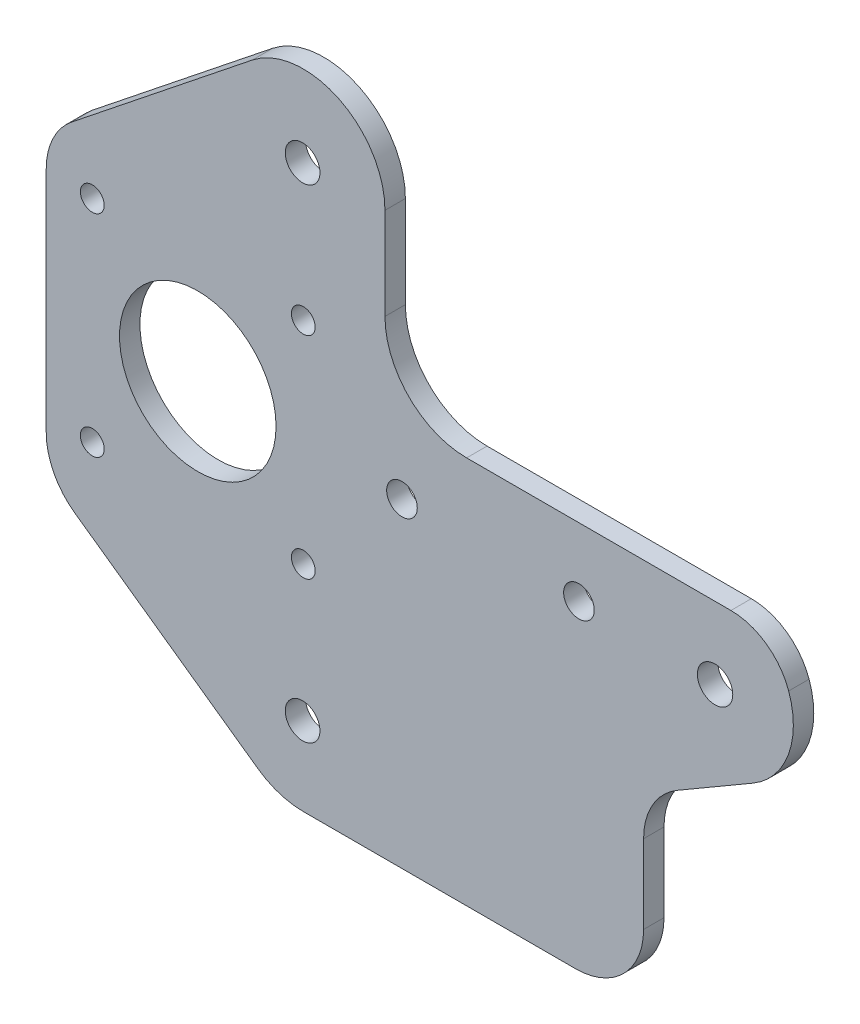
ISO-10303-21;
HEADER;
FILE_DESCRIPTION(('STEP AP214'),'2;1');
FILE_NAME('part.step','',(''),(''),'','','');
FILE_SCHEMA(('AUTOMOTIVE_DESIGN { 1 0 10303 214 1 1 1 1 }'));
ENDSEC;
DATA;
#1=APPLICATION_CONTEXT('core data for automotive mechanical design processes');
#2=APPLICATION_PROTOCOL_DEFINITION('international standard','automotive_design',2000,#1);
#3=PRODUCT_CONTEXT('',#1,'mechanical');
#4=PRODUCT('Part','Part','',(#3));
#5=PRODUCT_RELATED_PRODUCT_CATEGORY('part','',(#4));
#6=PRODUCT_DEFINITION_FORMATION('','',#4);
#7=PRODUCT_DEFINITION_CONTEXT('part definition',#1,'design');
#8=PRODUCT_DEFINITION('design','',#6,#7);
#9=PRODUCT_DEFINITION_SHAPE('','',#8);
#10=(LENGTH_UNIT() NAMED_UNIT(*) SI_UNIT(.MILLI.,.METRE.));
#11=(NAMED_UNIT(*) PLANE_ANGLE_UNIT() SI_UNIT($,.RADIAN.));
#12=(NAMED_UNIT(*) SI_UNIT($,.STERADIAN.) SOLID_ANGLE_UNIT());
#13=UNCERTAINTY_MEASURE_WITH_UNIT(LENGTH_MEASURE(1.E-05),#10,'distance_accuracy_value','');
#14=(GEOMETRIC_REPRESENTATION_CONTEXT(3) GLOBAL_UNCERTAINTY_ASSIGNED_CONTEXT((#13)) GLOBAL_UNIT_ASSIGNED_CONTEXT((#10,
#11,#12)) REPRESENTATION_CONTEXT('',''));
#15=CARTESIAN_POINT('',(0.,0.,0.));
#16=DIRECTION('',(0.,0.,1.));
#17=DIRECTION('',(1.,0.,0.));
#18=AXIS2_PLACEMENT_3D('',#15,#16,#17);
#19=CARTESIAN_POINT('',(0.,0.,0.));
#20=DIRECTION('',(0.,0.,1.));
#21=DIRECTION('',(1.,0.,0.));
#22=AXIS2_PLACEMENT_3D('',#19,#20,#21);
#23=PLANE('',#22);
#24=CARTESIAN_POINT('',(30.,0.,0.));
#25=DIRECTION('',(0.,0.,1.));
#26=DIRECTION('',(1.,0.,0.));
#27=AXIS2_PLACEMENT_3D('',#24,#25,#26);
#28=CIRCLE('',#27,2.25);
#29=CARTESIAN_POINT('',(32.25,0.,0.));
#30=VERTEX_POINT('',#29);
#31=EDGE_CURVE('E152',#30,#30,#28,.T.);
#32=ORIENTED_EDGE('',*,*,#31,.T.);
#33=EDGE_LOOP('',(#32));
#34=FACE_BOUND('',#33,.T.);
#35=CARTESIAN_POINT('',(15.4,-35.5,0.));
#36=DIRECTION('',(0.,0.,1.));
#37=DIRECTION('',(1.,0.,0.));
#38=AXIS2_PLACEMENT_3D('',#35,#36,#37);
#39=CIRCLE('',#38,2.55);
#40=CARTESIAN_POINT('',(17.95,-35.5,0.));
#41=VERTEX_POINT('',#40);
#42=EDGE_CURVE('E280',#41,#41,#39,.T.);
#43=ORIENTED_EDGE('',*,*,#42,.T.);
#44=EDGE_LOOP('',(#43));
#45=FACE_BOUND('',#44,.T.);
#46=CARTESIAN_POINT('',(15.4,35.5,0.));
#47=DIRECTION('',(0.,0.,1.));
#48=DIRECTION('',(1.,0.,0.));
#49=AXIS2_PLACEMENT_3D('',#46,#47,#48);
#50=CIRCLE('',#49,2.55);
#51=CARTESIAN_POINT('',(17.95,35.5,0.));
#52=VERTEX_POINT('',#51);
#53=EDGE_CURVE('E259',#52,#52,#50,.T.);
#54=ORIENTED_EDGE('',*,*,#53,.T.);
#55=EDGE_LOOP('',(#54));
#56=FACE_BOUND('',#55,.T.);
#57=CARTESIAN_POINT('',(-15.5,15.5,0.));
#58=DIRECTION('',(0.,0.,1.));
#59=DIRECTION('',(1.,0.,0.));
#60=AXIS2_PLACEMENT_3D('',#57,#58,#59);
#61=CIRCLE('',#60,1.75);
#62=CARTESIAN_POINT('',(-13.75,15.5,0.));
#63=VERTEX_POINT('',#62);
#64=EDGE_CURVE('E283',#63,#63,#61,.T.);
#65=ORIENTED_EDGE('',*,*,#64,.T.);
#66=EDGE_LOOP('',(#65));
#67=FACE_BOUND('',#66,.T.);
#68=CARTESIAN_POINT('',(-15.5,-15.5,0.));
#69=DIRECTION('',(0.,0.,1.));
#70=DIRECTION('',(1.,0.,0.));
#71=AXIS2_PLACEMENT_3D('',#68,#69,#70);
#72=CIRCLE('',#71,1.75);
#73=CARTESIAN_POINT('',(-13.75,-15.5,0.));
#74=VERTEX_POINT('',#73);
#75=EDGE_CURVE('E256',#74,#74,#72,.T.);
#76=ORIENTED_EDGE('',*,*,#75,.T.);
#77=EDGE_LOOP('',(#76));
#78=FACE_BOUND('',#77,.T.);
#79=CARTESIAN_POINT('',(15.5,-15.5,0.));
#80=DIRECTION('',(0.,0.,1.));
#81=DIRECTION('',(1.,0.,0.));
#82=AXIS2_PLACEMENT_3D('',#79,#80,#81);
#83=CIRCLE('',#82,1.75);
#84=CARTESIAN_POINT('',(17.25,-15.5,0.));
#85=VERTEX_POINT('',#84);
#86=EDGE_CURVE('E286',#85,#85,#83,.T.);
#87=ORIENTED_EDGE('',*,*,#86,.T.);
#88=EDGE_LOOP('',(#87));
#89=FACE_BOUND('',#88,.T.);
#90=CARTESIAN_POINT('',(15.5,15.5,0.));
#91=DIRECTION('',(0.,0.,1.));
#92=DIRECTION('',(1.,0.,0.));
#93=AXIS2_PLACEMENT_3D('',#90,#91,#92);
#94=CIRCLE('',#93,1.75);
#95=CARTESIAN_POINT('',(17.25,15.5,0.));
#96=VERTEX_POINT('',#95);
#97=EDGE_CURVE('E253',#96,#96,#94,.T.);
#98=ORIENTED_EDGE('',*,*,#97,.T.);
#99=EDGE_LOOP('',(#98));
#100=FACE_BOUND('',#99,.T.);
#101=CARTESIAN_POINT('',(0.,0.,0.));
#102=DIRECTION('',(0.,0.,1.));
#103=DIRECTION('',(1.,0.,0.));
#104=AXIS2_PLACEMENT_3D('',#101,#102,#103);
#105=CIRCLE('',#104,11.5);
#106=CARTESIAN_POINT('',(11.5,0.,0.));
#107=VERTEX_POINT('',#106);
#108=EDGE_CURVE('E288',#107,#107,#105,.T.);
#109=ORIENTED_EDGE('',*,*,#108,.T.);
#110=EDGE_LOOP('',(#109));
#111=FACE_BOUND('',#110,.T.);
#112=CARTESIAN_POINT('',(56.,0.,0.));
#113=DIRECTION('',(0.,0.,1.));
#114=DIRECTION('',(1.,0.,0.));
#115=AXIS2_PLACEMENT_3D('',#112,#113,#114);
#116=CIRCLE('',#115,2.25);
#117=CARTESIAN_POINT('',(58.25,0.,0.));
#118=VERTEX_POINT('',#117);
#119=EDGE_CURVE('E250',#118,#118,#116,.T.);
#120=ORIENTED_EDGE('',*,*,#119,.T.);
#121=EDGE_LOOP('',(#120));
#122=FACE_BOUND('',#121,.T.);
#123=CARTESIAN_POINT('',(75.5,0.,0.));
#124=DIRECTION('',(0.,0.,1.));
#125=DIRECTION('',(1.,0.,0.));
#126=AXIS2_PLACEMENT_3D('',#123,#124,#125);
#127=CIRCLE('',#126,12.);
#128=CARTESIAN_POINT('',(81.5363224728649,-10.3712492499026,0.));
#129=VERTEX_POINT('',#128);
#130=CARTESIAN_POINT('',(86.8137084989854,4.00000000000889,0.));
#131=VERTEX_POINT('',#130);
#132=EDGE_CURVE('E264',#129,#131,#127,.T.);
#133=ORIENTED_EDGE('',*,*,#132,.F.);
#134=DIRECTION('',(0.864270770825398,0.503026872738299,0.));
#135=VECTOR('',#134,1.);
#136=CARTESIAN_POINT('',(21.28480903649,-45.43911386449,0.));
#137=LINE('',#136,#135);
#138=CARTESIAN_POINT('',(70.4697312726384,-16.8122778618127,0.));
#139=VERTEX_POINT('',#138);
#140=EDGE_CURVE('E166',#139,#129,#137,.T.);
#141=ORIENTED_EDGE('',*,*,#140,.F.);
#142=CARTESIAN_POINT('',(75.5,-25.45498557008,0.));
#143=DIRECTION('',(0.,0.,1.));
#144=DIRECTION('',(1.,0.,0.));
#145=AXIS2_PLACEMENT_3D('',#142,#143,#144);
#146=CIRCLE('',#145,10.);
#147=CARTESIAN_POINT('',(65.5,-25.45498557008,0.));
#148=VERTEX_POINT('',#147);
#149=EDGE_CURVE('E174',#139,#148,#146,.T.);
#150=ORIENTED_EDGE('',*,*,#149,.T.);
#151=DIRECTION('',(0.,1.,0.));
#152=VECTOR('',#151,1.);
#153=CARTESIAN_POINT('',(65.5,-47.,0.));
#154=LINE('',#153,#152);
#155=CARTESIAN_POINT('',(65.5,-37.,0.));
#156=VERTEX_POINT('',#155);
#157=EDGE_CURVE('E171',#156,#148,#154,.T.);
#158=ORIENTED_EDGE('',*,*,#157,.F.);
#159=CARTESIAN_POINT('',(55.5,-37.,0.));
#160=DIRECTION('',(0.,0.,-1.));
#161=DIRECTION('',(-1.,0.,0.));
#162=AXIS2_PLACEMENT_3D('',#159,#160,#161);
#163=CIRCLE('',#162,10.);
#164=CARTESIAN_POINT('',(55.5,-47.,0.));
#165=VERTEX_POINT('',#164);
#166=EDGE_CURVE('E269',#165,#156,#163,.F.);
#167=ORIENTED_EDGE('',*,*,#166,.F.);
#168=DIRECTION('',(1.,0.,0.));
#169=VECTOR('',#168,1.);
#170=CARTESIAN_POINT('',(15.5,-47.,0.));
#171=LINE('',#170,#169);
#172=CARTESIAN_POINT('',(15.5,-47.,0.));
#173=VERTEX_POINT('',#172);
#174=EDGE_CURVE('E176',#173,#165,#171,.T.);
#175=ORIENTED_EDGE('',*,*,#174,.F.);
#176=CARTESIAN_POINT('',(15.5,-35.5,0.));
#177=DIRECTION('',(0.,0.,1.));
#178=DIRECTION('',(1.,0.,0.));
#179=AXIS2_PLACEMENT_3D('',#176,#177,#178);
#180=CIRCLE('',#179,11.5);
#181=CARTESIAN_POINT('',(8.8483318687912,-44.8811145964812,0.));
#182=VERTEX_POINT('',#181);
#183=EDGE_CURVE('E271',#182,#173,#180,.T.);
#184=ORIENTED_EDGE('',*,*,#183,.F.);
#185=DIRECTION('',(0.815749095346485,-0.578405924452189,0.));
#186=VECTOR('',#185,1.);
#187=CARTESIAN_POINT('',(-18.04825369201,-25.81012263995,0.));
#188=LINE('',#187,#186);
#189=CARTESIAN_POINT('',(-18.0482536919971,-25.8101226399591,0.));
#190=VERTEX_POINT('',#189);
#191=EDGE_CURVE('E180',#190,#182,#188,.T.);
#192=ORIENTED_EDGE('',*,*,#191,.F.);
#193=CARTESIAN_POINT('',(-12.26419444749,-17.65263168648,0.));
#194=DIRECTION('',(0.,0.,1.));
#195=DIRECTION('',(1.,0.,0.));
#196=AXIS2_PLACEMENT_3D('',#193,#194,#195);
#197=CIRCLE('',#196,10.);
#198=CARTESIAN_POINT('',(-22.26419444749,-17.65263168648,0.));
#199=VERTEX_POINT('',#198);
#200=EDGE_CURVE('E273',#199,#190,#197,.T.);
#201=ORIENTED_EDGE('',*,*,#200,.F.);
#202=DIRECTION('',(0.,1.,0.));
#203=VECTOR('',#202,1.);
#204=CARTESIAN_POINT('',(-22.26419444749,15.91967145146,0.));
#205=LINE('',#204,#203);
#206=CARTESIAN_POINT('',(-22.26419444749,15.91967145146,0.));
#207=VERTEX_POINT('',#206);
#208=EDGE_CURVE('E184',#207,#199,#205,.F.);
#209=ORIENTED_EDGE('',*,*,#208,.F.);
#210=CARTESIAN_POINT('',(-12.26419444749,15.91967145146,0.));
#211=DIRECTION('',(0.,0.,1.));
#212=DIRECTION('',(1.,0.,0.));
#213=AXIS2_PLACEMENT_3D('',#210,#211,#212);
#214=CIRCLE('',#213,10.);
#215=CARTESIAN_POINT('',(-18.4985911058109,23.7383860713092,0.));
#216=VERTEX_POINT('',#215);
#217=EDGE_CURVE('E275',#216,#207,#214,.T.);
#218=ORIENTED_EDGE('',*,*,#217,.F.);
#219=DIRECTION('',(-0.781871461986013,-0.62343966583131,0.));
#220=VECTOR('',#219,1.);
#221=CARTESIAN_POINT('',(8.018724010025,44.88245754383,0.));
#222=LINE('',#221,#220);
#223=CARTESIAN_POINT('',(8.01872401003507,44.882457543838,0.));
#224=VERTEX_POINT('',#223);
#225=EDGE_CURVE('E188',#224,#216,#222,.T.);
#226=ORIENTED_EDGE('',*,*,#225,.F.);
#227=CARTESIAN_POINT('',(15.5,35.5,0.));
#228=DIRECTION('',(0.,0.,1.));
#229=DIRECTION('',(1.,0.,0.));
#230=AXIS2_PLACEMENT_3D('',#227,#228,#229);
#231=CIRCLE('',#230,12.);
#232=CARTESIAN_POINT('',(27.5,35.5,0.));
#233=VERTEX_POINT('',#232);
#234=EDGE_CURVE('E140',#233,#224,#231,.T.);
#235=ORIENTED_EDGE('',*,*,#234,.F.);
#236=DIRECTION('',(0.,1.,0.));
#237=VECTOR('',#236,1.);
#238=CARTESIAN_POINT('',(27.5,35.5,0.));
#239=LINE('',#238,#237);
#240=CARTESIAN_POINT('',(27.5,22.,0.));
#241=VERTEX_POINT('',#240);
#242=EDGE_CURVE('E134',#233,#241,#239,.F.);
#243=ORIENTED_EDGE('',*,*,#242,.T.);
#244=CARTESIAN_POINT('',(39.5,22.,0.));
#245=DIRECTION('',(0.,0.,1.));
#246=DIRECTION('',(1.,0.,0.));
#247=AXIS2_PLACEMENT_3D('',#244,#245,#246);
#248=CIRCLE('',#247,12.);
#249=CARTESIAN_POINT('',(39.5,10.,0.));
#250=VERTEX_POINT('',#249);
#251=EDGE_CURVE('E137',#241,#250,#248,.T.);
#252=ORIENTED_EDGE('',*,*,#251,.T.);
#253=DIRECTION('',(1.,0.,0.));
#254=VECTOR('',#253,1.);
#255=CARTESIAN_POINT('',(39.5,10.,0.));
#256=LINE('',#255,#254);
#257=CARTESIAN_POINT('',(78.32842712475,10.,0.));
#258=VERTEX_POINT('',#257);
#259=EDGE_CURVE('E163',#250,#258,#256,.T.);
#260=ORIENTED_EDGE('',*,*,#259,.T.);
#261=CARTESIAN_POINT('',(78.32842712475,1.,0.));
#262=DIRECTION('',(0.,0.,1.));
#263=DIRECTION('',(1.,0.,0.));
#264=AXIS2_PLACEMENT_3D('',#261,#262,#263);
#265=CIRCLE('',#264,9.00000000000001);
#266=EDGE_CURVE('E262',#131,#258,#265,.T.);
#267=ORIENTED_EDGE('',*,*,#266,.F.);
#268=EDGE_LOOP('',(#133,#141,#150,#158,#167,#175,#184,#192,#201,#209,#218,#226,#235,#243,#252,
#260,#267));
#269=FACE_BOUND('',#268,.T.);
#270=CARTESIAN_POINT('',(76.,-0.574456264653834,0.));
#271=DIRECTION('',(0.,0.,1.));
#272=DIRECTION('',(1.,0.,0.));
#273=AXIS2_PLACEMENT_3D('',#270,#271,#272);
#274=CIRCLE('',#273,2.6);
#275=CARTESIAN_POINT('',(78.6,-0.574456264653834,0.));
#276=VERTEX_POINT('',#275);
#277=EDGE_CURVE('E20',#276,#276,#274,.T.);
#278=ORIENTED_EDGE('',*,*,#277,.T.);
#279=EDGE_LOOP('',(#278));
#280=FACE_BOUND('',#279,.T.);
#281=ADVANCED_FACE('F17',(#34,#45,#56,#67,#78,#89,#100,#111,#122,#269,#280),#23,.F.);
#282=CARTESIAN_POINT('',(76.,-0.574456264653834,3.));
#283=DIRECTION('',(0.,0.,1.));
#284=DIRECTION('',(1.,0.,0.));
#285=AXIS2_PLACEMENT_3D('',#282,#283,#284);
#286=CYLINDRICAL_SURFACE('',#285,2.6);
#287=CARTESIAN_POINT('',(76.,-0.574456264653834,3.));
#288=DIRECTION('',(0.,0.,1.));
#289=DIRECTION('',(1.,0.,0.));
#290=AXIS2_PLACEMENT_3D('',#287,#288,#289);
#291=CIRCLE('',#290,2.6);
#292=CARTESIAN_POINT('',(78.6,-0.574456264653834,3.));
#293=VERTEX_POINT('',#292);
#294=EDGE_CURVE('E247',#293,#293,#291,.F.);
#295=ORIENTED_EDGE('',*,*,#294,.F.);
#296=EDGE_LOOP('',(#295));
#297=FACE_BOUND('',#296,.T.);
#298=ORIENTED_EDGE('',*,*,#277,.F.);
#299=EDGE_LOOP('',(#298));
#300=FACE_BOUND('',#299,.T.);
#301=ADVANCED_FACE('F295',(#297,#300),#286,.F.);
#302=CARTESIAN_POINT('',(0.,0.,0.));
#303=DIRECTION('',(0.,0.,1.));
#304=DIRECTION('',(1.,0.,0.));
#305=AXIS2_PLACEMENT_3D('',#302,#303,#304);
#306=CYLINDRICAL_SURFACE('',#305,11.5);
#307=CARTESIAN_POINT('',(0.,0.,3.));
#308=DIRECTION('',(0.,0.,1.));
#309=DIRECTION('',(1.,0.,0.));
#310=AXIS2_PLACEMENT_3D('',#307,#308,#309);
#311=CIRCLE('',#310,11.5);
#312=CARTESIAN_POINT('',(11.5,0.,3.));
#313=VERTEX_POINT('',#312);
#314=EDGE_CURVE('E244',#313,#313,#311,.F.);
#315=ORIENTED_EDGE('',*,*,#314,.F.);
#316=EDGE_LOOP('',(#315));
#317=FACE_BOUND('',#316,.T.);
#318=ORIENTED_EDGE('',*,*,#108,.F.);
#319=EDGE_LOOP('',(#318));
#320=FACE_BOUND('',#319,.T.);
#321=ADVANCED_FACE('F297',(#317,#320),#306,.F.);
#322=CARTESIAN_POINT('',(15.5,-15.5,0.));
#323=DIRECTION('',(0.,0.,1.));
#324=DIRECTION('',(1.,0.,0.));
#325=AXIS2_PLACEMENT_3D('',#322,#323,#324);
#326=CYLINDRICAL_SURFACE('',#325,1.75);
#327=CARTESIAN_POINT('',(15.5,-15.5,3.));
#328=DIRECTION('',(0.,0.,1.));
#329=DIRECTION('',(1.,0.,0.));
#330=AXIS2_PLACEMENT_3D('',#327,#328,#329);
#331=CIRCLE('',#330,1.75);
#332=CARTESIAN_POINT('',(17.25,-15.5,3.));
#333=VERTEX_POINT('',#332);
#334=EDGE_CURVE('E241',#333,#333,#331,.F.);
#335=ORIENTED_EDGE('',*,*,#334,.F.);
#336=EDGE_LOOP('',(#335));
#337=FACE_BOUND('',#336,.T.);
#338=ORIENTED_EDGE('',*,*,#86,.F.);
#339=EDGE_LOOP('',(#338));
#340=FACE_BOUND('',#339,.T.);
#341=ADVANCED_FACE('F304',(#337,#340),#326,.F.);
#342=CARTESIAN_POINT('',(-15.5,15.5,0.));
#343=DIRECTION('',(0.,0.,1.));
#344=DIRECTION('',(1.,0.,0.));
#345=AXIS2_PLACEMENT_3D('',#342,#343,#344);
#346=CYLINDRICAL_SURFACE('',#345,1.75);
#347=CARTESIAN_POINT('',(-15.5,15.5,3.));
#348=DIRECTION('',(0.,0.,1.));
#349=DIRECTION('',(1.,0.,0.));
#350=AXIS2_PLACEMENT_3D('',#347,#348,#349);
#351=CIRCLE('',#350,1.75);
#352=CARTESIAN_POINT('',(-13.75,15.5,3.));
#353=VERTEX_POINT('',#352);
#354=EDGE_CURVE('E238',#353,#353,#351,.F.);
#355=ORIENTED_EDGE('',*,*,#354,.F.);
#356=EDGE_LOOP('',(#355));
#357=FACE_BOUND('',#356,.T.);
#358=ORIENTED_EDGE('',*,*,#64,.F.);
#359=EDGE_LOOP('',(#358));
#360=FACE_BOUND('',#359,.T.);
#361=ADVANCED_FACE('F403',(#357,#360),#346,.F.);
#362=CARTESIAN_POINT('',(15.4,-35.5,0.));
#363=DIRECTION('',(0.,0.,1.));
#364=DIRECTION('',(1.,0.,0.));
#365=AXIS2_PLACEMENT_3D('',#362,#363,#364);
#366=CYLINDRICAL_SURFACE('',#365,2.55);
#367=CARTESIAN_POINT('',(15.4,-35.5,3.));
#368=DIRECTION('',(0.,0.,1.));
#369=DIRECTION('',(1.,0.,0.));
#370=AXIS2_PLACEMENT_3D('',#367,#368,#369);
#371=CIRCLE('',#370,2.55);
#372=CARTESIAN_POINT('',(17.95,-35.5,3.));
#373=VERTEX_POINT('',#372);
#374=EDGE_CURVE('E235',#373,#373,#371,.F.);
#375=ORIENTED_EDGE('',*,*,#374,.F.);
#376=EDGE_LOOP('',(#375));
#377=FACE_BOUND('',#376,.T.);
#378=ORIENTED_EDGE('',*,*,#42,.F.);
#379=EDGE_LOOP('',(#378));
#380=FACE_BOUND('',#379,.T.);
#381=ADVANCED_FACE('F399',(#377,#380),#366,.F.);
#382=CARTESIAN_POINT('',(30.,0.,3.));
#383=DIRECTION('',(0.,0.,1.));
#384=DIRECTION('',(1.,0.,0.));
#385=AXIS2_PLACEMENT_3D('',#382,#383,#384);
#386=CYLINDRICAL_SURFACE('',#385,2.25);
#387=CARTESIAN_POINT('',(30.,0.,3.));
#388=DIRECTION('',(0.,0.,1.));
#389=DIRECTION('',(1.,0.,0.));
#390=AXIS2_PLACEMENT_3D('',#387,#388,#389);
#391=CIRCLE('',#390,2.25);
#392=CARTESIAN_POINT('',(32.25,0.,3.));
#393=VERTEX_POINT('',#392);
#394=EDGE_CURVE('E232',#393,#393,#391,.F.);
#395=ORIENTED_EDGE('',*,*,#394,.F.);
#396=EDGE_LOOP('',(#395));
#397=FACE_BOUND('',#396,.T.);
#398=ORIENTED_EDGE('',*,*,#31,.F.);
#399=EDGE_LOOP('',(#398));
#400=FACE_BOUND('',#399,.T.);
#401=ADVANCED_FACE('F396',(#397,#400),#386,.F.);
#402=CARTESIAN_POINT('',(39.5,22.,3.));
#403=DIRECTION('',(0.,0.,1.));
#404=DIRECTION('',(1.,0.,0.));
#405=AXIS2_PLACEMENT_3D('',#402,#403,#404);
#406=CYLINDRICAL_SURFACE('',#405,12.);
#407=CARTESIAN_POINT('',(39.5,22.,3.));
#408=DIRECTION('',(0.,0.,1.));
#409=DIRECTION('',(1.,0.,0.));
#410=AXIS2_PLACEMENT_3D('',#407,#408,#409);
#411=CIRCLE('',#410,12.);
#412=CARTESIAN_POINT('',(39.5,9.99999999999987,3.));
#413=VERTEX_POINT('',#412);
#414=CARTESIAN_POINT('',(27.5,22.,3.));
#415=VERTEX_POINT('',#414);
#416=EDGE_CURVE('E230',#413,#415,#411,.F.);
#417=ORIENTED_EDGE('',*,*,#416,.F.);
#418=DIRECTION('',(0.,0.,-1.));
#419=VECTOR('',#418,1.);
#420=CARTESIAN_POINT('',(39.5,10.,3.));
#421=LINE('',#420,#419);
#422=EDGE_CURVE('E150',#413,#250,#421,.T.);
#423=ORIENTED_EDGE('',*,*,#422,.T.);
#424=ORIENTED_EDGE('',*,*,#251,.F.);
#425=DIRECTION('',(0.,0.,1.));
#426=VECTOR('',#425,1.);
#427=CARTESIAN_POINT('',(27.5,22.,3.));
#428=LINE('',#427,#426);
#429=EDGE_CURVE('E144',#241,#415,#428,.T.);
#430=ORIENTED_EDGE('',*,*,#429,.T.);
#431=EDGE_LOOP('',(#417,#423,#424,#430));
#432=FACE_BOUND('',#431,.T.);
#433=ADVANCED_FACE('F147',(#432),#406,.F.);
#434=CARTESIAN_POINT('',(27.5,35.5,3.));
#435=DIRECTION('',(-1.,0.,0.));
#436=DIRECTION('',(0.,0.,1.));
#437=AXIS2_PLACEMENT_3D('',#434,#435,#436);
#438=PLANE('',#437);
#439=DIRECTION('',(0.,1.,0.));
#440=VECTOR('',#439,1.);
#441=CARTESIAN_POINT('',(27.5,22.,3.));
#442=LINE('',#441,#440);
#443=CARTESIAN_POINT('',(27.5,35.5,3.));
#444=VERTEX_POINT('',#443);
#445=EDGE_CURVE('E156',#415,#444,#442,.T.);
#446=ORIENTED_EDGE('',*,*,#445,.F.);
#447=ORIENTED_EDGE('',*,*,#429,.F.);
#448=ORIENTED_EDGE('',*,*,#242,.F.);
#449=DIRECTION('',(0.,0.,1.));
#450=VECTOR('',#449,1.);
#451=CARTESIAN_POINT('',(27.5,35.5,0.));
#452=LINE('',#451,#450);
#453=EDGE_CURVE('E158',#444,#233,#452,.F.);
#454=ORIENTED_EDGE('',*,*,#453,.F.);
#455=EDGE_LOOP('',(#446,#447,#448,#454));
#456=FACE_BOUND('',#455,.T.);
#457=ADVANCED_FACE('F154',(#456),#438,.F.);
#458=CARTESIAN_POINT('',(15.5,35.5,0.));
#459=DIRECTION('',(0.,0.,1.));
#460=DIRECTION('',(1.,0.,0.));
#461=AXIS2_PLACEMENT_3D('',#458,#459,#460);
#462=CYLINDRICAL_SURFACE('',#461,12.);
#463=ORIENTED_EDGE('',*,*,#453,.T.);
#464=ORIENTED_EDGE('',*,*,#234,.T.);
#465=DIRECTION('',(0.,0.,1.));
#466=VECTOR('',#465,1.);
#467=CARTESIAN_POINT('',(8.01872401004453,44.8824575438456,0.));
#468=LINE('',#467,#466);
#469=CARTESIAN_POINT('',(8.01872401003358,44.8824575438399,3.));
#470=VERTEX_POINT('',#469);
#471=EDGE_CURVE('E190',#470,#224,#468,.F.);
#472=ORIENTED_EDGE('',*,*,#471,.F.);
#473=CARTESIAN_POINT('',(15.5,35.5,3.));
#474=DIRECTION('',(0.,0.,1.));
#475=DIRECTION('',(1.,0.,0.));
#476=AXIS2_PLACEMENT_3D('',#473,#474,#475);
#477=CIRCLE('',#476,12.);
#478=EDGE_CURVE('E227',#444,#470,#477,.T.);
#479=ORIENTED_EDGE('',*,*,#478,.F.);
#480=EDGE_LOOP('',(#463,#464,#472,#479));
#481=FACE_BOUND('',#480,.T.);
#482=ADVANCED_FACE('F387',(#481),#462,.T.);
#483=CARTESIAN_POINT('',(8.018724010025,44.88245754383,0.));
#484=DIRECTION('',(-0.62343966583131,0.781871461986013,0.));
#485=DIRECTION('',(-0.781871461986013,-0.62343966583131,0.));
#486=AXIS2_PLACEMENT_3D('',#483,#484,#485);
#487=PLANE('',#486);
#488=ORIENTED_EDGE('',*,*,#471,.T.);
#489=ORIENTED_EDGE('',*,*,#225,.T.);
#490=DIRECTION('',(0.,0.,1.));
#491=VECTOR('',#490,1.);
#492=CARTESIAN_POINT('',(-18.4985911058232,23.7383860713041,0.));
#493=LINE('',#492,#491);
#494=CARTESIAN_POINT('',(-18.4985911058124,23.7383860713111,3.));
#495=VERTEX_POINT('',#494);
#496=EDGE_CURVE('E189',#495,#216,#493,.F.);
#497=ORIENTED_EDGE('',*,*,#496,.F.);
#498=DIRECTION('',(-0.781871461986012,-0.62343966583131,0.));
#499=VECTOR('',#498,1.);
#500=CARTESIAN_POINT('',(8.01872401004155,44.8824575438493,3.));
#501=LINE('',#500,#499);
#502=EDGE_CURVE('E226',#470,#495,#501,.T.);
#503=ORIENTED_EDGE('',*,*,#502,.F.);
#504=EDGE_LOOP('',(#488,#489,#497,#503));
#505=FACE_BOUND('',#504,.T.);
#506=ADVANCED_FACE('F383',(#505),#487,.T.);
#507=CARTESIAN_POINT('',(-12.26419444749,15.91967145146,0.));
#508=DIRECTION('',(0.,0.,1.));
#509=DIRECTION('',(1.,0.,0.));
#510=AXIS2_PLACEMENT_3D('',#507,#508,#509);
#511=CYLINDRICAL_SURFACE('',#510,10.);
#512=ORIENTED_EDGE('',*,*,#496,.T.);
#513=ORIENTED_EDGE('',*,*,#217,.T.);
#514=DIRECTION('',(0.,0.,1.));
#515=VECTOR('',#514,1.);
#516=CARTESIAN_POINT('',(-22.26419444749,15.91967145146,0.));
#517=LINE('',#516,#515);
#518=CARTESIAN_POINT('',(-22.2641944474894,15.91967145146,3.));
#519=VERTEX_POINT('',#518);
#520=EDGE_CURVE('E187',#519,#207,#517,.F.);
#521=ORIENTED_EDGE('',*,*,#520,.F.);
#522=CARTESIAN_POINT('',(-12.26419444749,15.91967145146,3.));
#523=DIRECTION('',(0.,0.,1.));
#524=DIRECTION('',(1.,0.,0.));
#525=AXIS2_PLACEMENT_3D('',#522,#523,#524);
#526=CIRCLE('',#525,10.);
#527=EDGE_CURVE('E223',#495,#519,#526,.T.);
#528=ORIENTED_EDGE('',*,*,#527,.F.);
#529=EDGE_LOOP('',(#512,#513,#521,#528));
#530=FACE_BOUND('',#529,.T.);
#531=ADVANCED_FACE('F379',(#530),#511,.T.);
#532=CARTESIAN_POINT('',(-22.26419444749,15.91967145146,0.));
#533=DIRECTION('',(-1.,0.,0.));
#534=DIRECTION('',(0.,0.,1.));
#535=AXIS2_PLACEMENT_3D('',#532,#533,#534);
#536=PLANE('',#535);
#537=ORIENTED_EDGE('',*,*,#520,.T.);
#538=ORIENTED_EDGE('',*,*,#208,.T.);
#539=DIRECTION('',(0.,0.,1.));
#540=VECTOR('',#539,1.);
#541=CARTESIAN_POINT('',(-22.26419444749,-17.65263168648,0.));
#542=LINE('',#541,#540);
#543=CARTESIAN_POINT('',(-22.2641944474894,-17.65263168648,3.));
#544=VERTEX_POINT('',#543);
#545=EDGE_CURVE('E186',#544,#199,#542,.F.);
#546=ORIENTED_EDGE('',*,*,#545,.F.);
#547=DIRECTION('',(0.,1.,0.));
#548=VECTOR('',#547,1.);
#549=CARTESIAN_POINT('',(-22.2641944474887,22.,3.));
#550=LINE('',#549,#548);
#551=EDGE_CURVE('E222',#519,#544,#550,.F.);
#552=ORIENTED_EDGE('',*,*,#551,.F.);
#553=EDGE_LOOP('',(#537,#538,#546,#552));
#554=FACE_BOUND('',#553,.T.);
#555=ADVANCED_FACE('F375',(#554),#536,.T.);
#556=CARTESIAN_POINT('',(-12.26419444749,-17.65263168648,0.));
#557=DIRECTION('',(0.,0.,1.));
#558=DIRECTION('',(1.,0.,0.));
#559=AXIS2_PLACEMENT_3D('',#556,#557,#558);
#560=CYLINDRICAL_SURFACE('',#559,10.);
#561=ORIENTED_EDGE('',*,*,#545,.T.);
#562=ORIENTED_EDGE('',*,*,#200,.T.);
#563=DIRECTION('',(0.,0.,1.));
#564=VECTOR('',#563,1.);
#565=CARTESIAN_POINT('',(-18.0482536919806,-25.8101226399708,0.));
#566=LINE('',#565,#564);
#567=CARTESIAN_POINT('',(-18.0482536919968,-25.8101226399584,3.));
#568=VERTEX_POINT('',#567);
#569=EDGE_CURVE('E183',#568,#190,#566,.F.);
#570=ORIENTED_EDGE('',*,*,#569,.F.);
#571=CARTESIAN_POINT('',(-12.26419444749,-17.65263168648,3.));
#572=DIRECTION('',(0.,0.,1.));
#573=DIRECTION('',(1.,0.,0.));
#574=AXIS2_PLACEMENT_3D('',#571,#572,#573);
#575=CIRCLE('',#574,10.);
#576=EDGE_CURVE('E219',#544,#568,#575,.T.);
#577=ORIENTED_EDGE('',*,*,#576,.F.);
#578=EDGE_LOOP('',(#561,#562,#570,#577));
#579=FACE_BOUND('',#578,.T.);
#580=ADVANCED_FACE('F371',(#579),#560,.T.);
#581=CARTESIAN_POINT('',(-18.04825369201,-25.81012263995,0.));
#582=DIRECTION('',(-0.578405924452189,-0.815749095346485,0.));
#583=DIRECTION('',(0.815749095346485,-0.578405924452189,0.));
#584=AXIS2_PLACEMENT_3D('',#581,#582,#583);
#585=PLANE('',#584);
#586=ORIENTED_EDGE('',*,*,#569,.T.);
#587=ORIENTED_EDGE('',*,*,#191,.T.);
#588=DIRECTION('',(0.,0.,1.));
#589=VECTOR('',#588,1.);
#590=CARTESIAN_POINT('',(8.84833186878513,-44.8811145964742,0.));
#591=LINE('',#590,#589);
#592=CARTESIAN_POINT('',(8.84833186879134,-44.8811145964808,3.));
#593=VERTEX_POINT('',#592);
#594=EDGE_CURVE('E182',#593,#182,#591,.F.);
#595=ORIENTED_EDGE('',*,*,#594,.F.);
#596=DIRECTION('',(0.815749095346473,-0.578405924452207,0.));
#597=VECTOR('',#596,1.);
#598=CARTESIAN_POINT('',(-18.0482536919797,-25.8101226399696,3.));
#599=LINE('',#598,#597);
#600=EDGE_CURVE('E218',#568,#593,#599,.T.);
#601=ORIENTED_EDGE('',*,*,#600,.F.);
#602=EDGE_LOOP('',(#586,#587,#595,#601));
#603=FACE_BOUND('',#602,.T.);
#604=ADVANCED_FACE('F367',(#603),#585,.T.);
#605=CARTESIAN_POINT('',(15.5,-35.5,0.));
#606=DIRECTION('',(0.,0.,1.));
#607=DIRECTION('',(1.,0.,0.));
#608=AXIS2_PLACEMENT_3D('',#605,#606,#607);
#609=CYLINDRICAL_SURFACE('',#608,11.5);
#610=DIRECTION('',(0.,0.,-1.));
#611=VECTOR('',#610,1.);
#612=CARTESIAN_POINT('',(15.5,-47.,3.));
#613=LINE('',#612,#611);
#614=CARTESIAN_POINT('',(15.5,-47.0000000000009,3.));
#615=VERTEX_POINT('',#614);
#616=EDGE_CURVE('E179',#615,#173,#613,.T.);
#617=ORIENTED_EDGE('',*,*,#616,.F.);
#618=CARTESIAN_POINT('',(15.5,-35.5,3.));
#619=DIRECTION('',(0.,0.,1.));
#620=DIRECTION('',(1.,0.,0.));
#621=AXIS2_PLACEMENT_3D('',#618,#619,#620);
#622=CIRCLE('',#621,11.5);
#623=EDGE_CURVE('E215',#593,#615,#622,.T.);
#624=ORIENTED_EDGE('',*,*,#623,.F.);
#625=ORIENTED_EDGE('',*,*,#594,.T.);
#626=ORIENTED_EDGE('',*,*,#183,.T.);
#627=EDGE_LOOP('',(#617,#624,#625,#626));
#628=FACE_BOUND('',#627,.T.);
#629=ADVANCED_FACE('F363',(#628),#609,.T.);
#630=CARTESIAN_POINT('',(15.5,-47.,3.));
#631=DIRECTION('',(0.,-1.,0.));
#632=DIRECTION('',(0.,0.,-1.));
#633=AXIS2_PLACEMENT_3D('',#630,#631,#632);
#634=PLANE('',#633);
#635=DIRECTION('',(0.,0.,-1.));
#636=VECTOR('',#635,1.);
#637=CARTESIAN_POINT('',(55.5,-47.,15.3276));
#638=LINE('',#637,#636);
#639=CARTESIAN_POINT('',(55.5,-47.0000000000009,3.));
#640=VERTEX_POINT('',#639);
#641=EDGE_CURVE('E178',#640,#165,#638,.T.);
#642=ORIENTED_EDGE('',*,*,#641,.F.);
#643=DIRECTION('',(1.,0.,0.));
#644=VECTOR('',#643,1.);
#645=CARTESIAN_POINT('',(39.5,-47.0000000000018,3.));
#646=LINE('',#645,#644);
#647=EDGE_CURVE('E214',#615,#640,#646,.T.);
#648=ORIENTED_EDGE('',*,*,#647,.F.);
#649=ORIENTED_EDGE('',*,*,#616,.T.);
#650=ORIENTED_EDGE('',*,*,#174,.T.);
#651=EDGE_LOOP('',(#642,#648,#649,#650));
#652=FACE_BOUND('',#651,.T.);
#653=ADVANCED_FACE('F359',(#652),#634,.T.);
#654=CARTESIAN_POINT('',(55.5,-37.,15.3276));
#655=DIRECTION('',(0.,0.,-1.));
#656=DIRECTION('',(-1.,0.,0.));
#657=AXIS2_PLACEMENT_3D('',#654,#655,#656);
#658=CYLINDRICAL_SURFACE('',#657,10.);
#659=ORIENTED_EDGE('',*,*,#641,.T.);
#660=ORIENTED_EDGE('',*,*,#166,.T.);
#661=DIRECTION('',(0.,0.,-1.));
#662=VECTOR('',#661,1.);
#663=CARTESIAN_POINT('',(65.5,-37.,3.));
#664=LINE('',#663,#662);
#665=CARTESIAN_POINT('',(65.5,-37.,3.));
#666=VERTEX_POINT('',#665);
#667=EDGE_CURVE('E175',#666,#156,#664,.T.);
#668=ORIENTED_EDGE('',*,*,#667,.F.);
#669=CARTESIAN_POINT('',(55.5,-37.,3.));
#670=DIRECTION('',(0.,0.,-1.));
#671=DIRECTION('',(-1.,0.,0.));
#672=AXIS2_PLACEMENT_3D('',#669,#670,#671);
#673=CIRCLE('',#672,10.);
#674=EDGE_CURVE('E211',#640,#666,#673,.F.);
#675=ORIENTED_EDGE('',*,*,#674,.F.);
#676=EDGE_LOOP('',(#659,#660,#668,#675));
#677=FACE_BOUND('',#676,.T.);
#678=ADVANCED_FACE('F355',(#677),#658,.T.);
#679=CARTESIAN_POINT('',(65.5,-47.,3.));
#680=DIRECTION('',(1.,0.,0.));
#681=DIRECTION('',(0.,0.,-1.));
#682=AXIS2_PLACEMENT_3D('',#679,#680,#681);
#683=PLANE('',#682);
#684=ORIENTED_EDGE('',*,*,#667,.T.);
#685=ORIENTED_EDGE('',*,*,#157,.T.);
#686=DIRECTION('',(0.,0.,1.));
#687=VECTOR('',#686,1.);
#688=CARTESIAN_POINT('',(65.5,-25.45498557008,-12.3276));
#689=LINE('',#688,#687);
#690=CARTESIAN_POINT('',(65.5,-25.45498557008,3.));
#691=VERTEX_POINT('',#690);
#692=EDGE_CURVE('E268',#148,#691,#689,.T.);
#693=ORIENTED_EDGE('',*,*,#692,.T.);
#694=DIRECTION('',(0.,1.,0.));
#695=VECTOR('',#694,1.);
#696=CARTESIAN_POINT('',(65.5,22.,3.));
#697=LINE('',#696,#695);
#698=EDGE_CURVE('E210',#666,#691,#697,.T.);
#699=ORIENTED_EDGE('',*,*,#698,.F.);
#700=EDGE_LOOP('',(#684,#685,#693,#699));
#701=FACE_BOUND('',#700,.T.);
#702=ADVANCED_FACE('F351',(#701),#683,.T.);
#703=CARTESIAN_POINT('',(75.5,-25.45498557008,-12.3276));
#704=DIRECTION('',(0.,0.,1.));
#705=DIRECTION('',(1.,0.,0.));
#706=AXIS2_PLACEMENT_3D('',#703,#704,#705);
#707=CYLINDRICAL_SURFACE('',#706,10.);
#708=ORIENTED_EDGE('',*,*,#149,.F.);
#709=DIRECTION('',(0.,0.,1.));
#710=VECTOR('',#709,1.);
#711=CARTESIAN_POINT('',(70.4697312726601,-16.8122778618001,0.));
#712=LINE('',#711,#710);
#713=CARTESIAN_POINT('',(70.469731272638,-16.812277861813,3.));
#714=VERTEX_POINT('',#713);
#715=EDGE_CURVE('E170',#714,#139,#712,.F.);
#716=ORIENTED_EDGE('',*,*,#715,.F.);
#717=CARTESIAN_POINT('',(75.5,-25.45498557008,3.));
#718=DIRECTION('',(0.,0.,1.));
#719=DIRECTION('',(1.,0.,0.));
#720=AXIS2_PLACEMENT_3D('',#717,#718,#719);
#721=CIRCLE('',#720,10.);
#722=EDGE_CURVE('E207',#691,#714,#721,.F.);
#723=ORIENTED_EDGE('',*,*,#722,.F.);
#724=ORIENTED_EDGE('',*,*,#692,.F.);
#725=EDGE_LOOP('',(#708,#716,#723,#724));
#726=FACE_BOUND('',#725,.T.);
#727=ADVANCED_FACE('F347',(#726),#707,.F.);
#728=CARTESIAN_POINT('',(21.28480903649,-45.43911386449,0.));
#729=DIRECTION('',(0.503026872738299,-0.864270770825398,0.));
#730=DIRECTION('',(0.864270770825398,0.503026872738299,0.));
#731=AXIS2_PLACEMENT_3D('',#728,#729,#730);
#732=PLANE('',#731);
#733=ORIENTED_EDGE('',*,*,#715,.T.);
#734=ORIENTED_EDGE('',*,*,#140,.T.);
#735=DIRECTION('',(0.,0.,1.));
#736=VECTOR('',#735,1.);
#737=CARTESIAN_POINT('',(81.5363224728694,-10.371249249899,0.));
#738=LINE('',#737,#736);
#739=CARTESIAN_POINT('',(81.5363224728651,-10.3712492499019,3.));
#740=VERTEX_POINT('',#739);
#741=EDGE_CURVE('E169',#740,#129,#738,.F.);
#742=ORIENTED_EDGE('',*,*,#741,.F.);
#743=DIRECTION('',(0.86427077082535,0.503026872738381,0.));
#744=VECTOR('',#743,1.);
#745=CARTESIAN_POINT('',(70.4697312726601,-16.8122778618002,3.));
#746=LINE('',#745,#744);
#747=EDGE_CURVE('E206',#714,#740,#746,.T.);
#748=ORIENTED_EDGE('',*,*,#747,.F.);
#749=EDGE_LOOP('',(#733,#734,#742,#748));
#750=FACE_BOUND('',#749,.T.);
#751=ADVANCED_FACE('F343',(#750),#732,.T.);
#752=CARTESIAN_POINT('',(75.5,0.,0.));
#753=DIRECTION('',(0.,0.,1.));
#754=DIRECTION('',(1.,0.,0.));
#755=AXIS2_PLACEMENT_3D('',#752,#753,#754);
#756=CYLINDRICAL_SURFACE('',#755,12.);
#757=DIRECTION('',(0.,0.,1.));
#758=VECTOR('',#757,1.);
#759=CARTESIAN_POINT('',(86.813708498981,4.00000000002136,-11.1252));
#760=LINE('',#759,#758);
#761=CARTESIAN_POINT('',(86.8137084989854,4.00000000000889,3.));
#762=VERTEX_POINT('',#761);
#763=EDGE_CURVE('E165',#762,#131,#760,.F.);
#764=ORIENTED_EDGE('',*,*,#763,.F.);
#765=CARTESIAN_POINT('',(75.5,0.,3.));
#766=DIRECTION('',(0.,0.,1.));
#767=DIRECTION('',(1.,0.,0.));
#768=AXIS2_PLACEMENT_3D('',#765,#766,#767);
#769=CIRCLE('',#768,12.);
#770=EDGE_CURVE('E204',#740,#762,#769,.T.);
#771=ORIENTED_EDGE('',*,*,#770,.F.);
#772=ORIENTED_EDGE('',*,*,#741,.T.);
#773=ORIENTED_EDGE('',*,*,#132,.T.);
#774=EDGE_LOOP('',(#764,#771,#772,#773));
#775=FACE_BOUND('',#774,.T.);
#776=ADVANCED_FACE('F340',(#775),#756,.T.);
#777=CARTESIAN_POINT('',(78.32842712475,1.,-11.1252));
#778=DIRECTION('',(0.,0.,1.));
#779=DIRECTION('',(1.,0.,0.));
#780=AXIS2_PLACEMENT_3D('',#777,#778,#779);
#781=CYLINDRICAL_SURFACE('',#780,9.00000000000001);
#782=CARTESIAN_POINT('',(78.32842712475,1.,3.));
#783=DIRECTION('',(0.,0.,1.));
#784=DIRECTION('',(1.,0.,0.));
#785=AXIS2_PLACEMENT_3D('',#782,#783,#784);
#786=CIRCLE('',#785,9.00000000000001);
#787=CARTESIAN_POINT('',(78.32842712475,9.99999999999987,3.));
#788=VERTEX_POINT('',#787);
#789=EDGE_CURVE('E201',#762,#788,#786,.T.);
#790=ORIENTED_EDGE('',*,*,#789,.F.);
#791=ORIENTED_EDGE('',*,*,#763,.T.);
#792=ORIENTED_EDGE('',*,*,#266,.T.);
#793=DIRECTION('',(0.,0.,-1.));
#794=VECTOR('',#793,1.);
#795=CARTESIAN_POINT('',(78.32842712475,10.,3.));
#796=LINE('',#795,#794);
#797=EDGE_CURVE('E35',#258,#788,#796,.F.);
#798=ORIENTED_EDGE('',*,*,#797,.T.);
#799=EDGE_LOOP('',(#790,#791,#792,#798));
#800=FACE_BOUND('',#799,.T.);
#801=ADVANCED_FACE('F336',(#800),#781,.T.);
#802=CARTESIAN_POINT('',(39.5,10.,3.));
#803=DIRECTION('',(0.,-1.,0.));
#804=DIRECTION('',(0.,0.,-1.));
#805=AXIS2_PLACEMENT_3D('',#802,#803,#804);
#806=PLANE('',#805);
#807=DIRECTION('',(1.,0.,0.));
#808=VECTOR('',#807,1.);
#809=CARTESIAN_POINT('',(39.5,9.99999999999974,3.));
#810=LINE('',#809,#808);
#811=EDGE_CURVE('E200',#788,#413,#810,.F.);
#812=ORIENTED_EDGE('',*,*,#811,.F.);
#813=ORIENTED_EDGE('',*,*,#797,.F.);
#814=ORIENTED_EDGE('',*,*,#259,.F.);
#815=ORIENTED_EDGE('',*,*,#422,.F.);
#816=EDGE_LOOP('',(#812,#813,#814,#815));
#817=FACE_BOUND('',#816,.T.);
#818=ADVANCED_FACE('F332',(#817),#806,.F.);
#819=CARTESIAN_POINT('',(15.4,35.5,0.));
#820=DIRECTION('',(0.,0.,1.));
#821=DIRECTION('',(1.,0.,0.));
#822=AXIS2_PLACEMENT_3D('',#819,#820,#821);
#823=CYLINDRICAL_SURFACE('',#822,2.55);
#824=CARTESIAN_POINT('',(15.4,35.5,3.));
#825=DIRECTION('',(0.,0.,1.));
#826=DIRECTION('',(1.,0.,0.));
#827=AXIS2_PLACEMENT_3D('',#824,#825,#826);
#828=CIRCLE('',#827,2.55);
#829=CARTESIAN_POINT('',(17.95,35.5,3.));
#830=VERTEX_POINT('',#829);
#831=EDGE_CURVE('E197',#830,#830,#828,.F.);
#832=ORIENTED_EDGE('',*,*,#831,.F.);
#833=EDGE_LOOP('',(#832));
#834=FACE_BOUND('',#833,.T.);
#835=ORIENTED_EDGE('',*,*,#53,.F.);
#836=EDGE_LOOP('',(#835));
#837=FACE_BOUND('',#836,.T.);
#838=ADVANCED_FACE('F328',(#834,#837),#823,.F.);
#839=CARTESIAN_POINT('',(-15.5,-15.5,0.));
#840=DIRECTION('',(0.,0.,1.));
#841=DIRECTION('',(1.,0.,0.));
#842=AXIS2_PLACEMENT_3D('',#839,#840,#841);
#843=CYLINDRICAL_SURFACE('',#842,1.75);
#844=CARTESIAN_POINT('',(-15.5,-15.5,3.));
#845=DIRECTION('',(0.,0.,1.));
#846=DIRECTION('',(1.,0.,0.));
#847=AXIS2_PLACEMENT_3D('',#844,#845,#846);
#848=CIRCLE('',#847,1.75);
#849=CARTESIAN_POINT('',(-13.75,-15.5,3.));
#850=VERTEX_POINT('',#849);
#851=EDGE_CURVE('E194',#850,#850,#848,.F.);
#852=ORIENTED_EDGE('',*,*,#851,.F.);
#853=EDGE_LOOP('',(#852));
#854=FACE_BOUND('',#853,.T.);
#855=ORIENTED_EDGE('',*,*,#75,.F.);
#856=EDGE_LOOP('',(#855));
#857=FACE_BOUND('',#856,.T.);
#858=ADVANCED_FACE('F324',(#854,#857),#843,.F.);
#859=CARTESIAN_POINT('',(15.5,15.5,0.));
#860=DIRECTION('',(0.,0.,1.));
#861=DIRECTION('',(1.,0.,0.));
#862=AXIS2_PLACEMENT_3D('',#859,#860,#861);
#863=CYLINDRICAL_SURFACE('',#862,1.75);
#864=CARTESIAN_POINT('',(15.5,15.5,3.));
#865=DIRECTION('',(0.,0.,1.));
#866=DIRECTION('',(1.,0.,0.));
#867=AXIS2_PLACEMENT_3D('',#864,#865,#866);
#868=CIRCLE('',#867,1.75);
#869=CARTESIAN_POINT('',(17.25,15.5,3.));
#870=VERTEX_POINT('',#869);
#871=EDGE_CURVE('E26',#870,#870,#868,.F.);
#872=ORIENTED_EDGE('',*,*,#871,.F.);
#873=EDGE_LOOP('',(#872));
#874=FACE_BOUND('',#873,.T.);
#875=ORIENTED_EDGE('',*,*,#97,.F.);
#876=EDGE_LOOP('',(#875));
#877=FACE_BOUND('',#876,.T.);
#878=ADVANCED_FACE('F317',(#874,#877),#863,.F.);
#879=CARTESIAN_POINT('',(56.,0.,3.));
#880=DIRECTION('',(0.,0.,1.));
#881=DIRECTION('',(1.,0.,0.));
#882=AXIS2_PLACEMENT_3D('',#879,#880,#881);
#883=CYLINDRICAL_SURFACE('',#882,2.25);
#884=CARTESIAN_POINT('',(56.,0.,3.));
#885=DIRECTION('',(0.,0.,1.));
#886=DIRECTION('',(1.,0.,0.));
#887=AXIS2_PLACEMENT_3D('',#884,#885,#886);
#888=CIRCLE('',#887,2.25);
#889=CARTESIAN_POINT('',(58.25,0.,3.));
#890=VERTEX_POINT('',#889);
#891=EDGE_CURVE('E11',#890,#890,#888,.F.);
#892=ORIENTED_EDGE('',*,*,#891,.F.);
#893=EDGE_LOOP('',(#892));
#894=FACE_BOUND('',#893,.T.);
#895=ORIENTED_EDGE('',*,*,#119,.F.);
#896=EDGE_LOOP('',(#895));
#897=FACE_BOUND('',#896,.T.);
#898=ADVANCED_FACE('F311',(#894,#897),#883,.F.);
#899=CARTESIAN_POINT('',(39.5,22.,3.));
#900=DIRECTION('',(0.,0.,1.));
#901=DIRECTION('',(1.,0.,0.));
#902=AXIS2_PLACEMENT_3D('',#899,#900,#901);
#903=PLANE('',#902);
#904=ORIENTED_EDGE('',*,*,#891,.T.);
#905=EDGE_LOOP('',(#904));
#906=FACE_BOUND('',#905,.T.);
#907=ORIENTED_EDGE('',*,*,#871,.T.);
#908=EDGE_LOOP('',(#907));
#909=FACE_BOUND('',#908,.T.);
#910=ORIENTED_EDGE('',*,*,#851,.T.);
#911=EDGE_LOOP('',(#910));
#912=FACE_BOUND('',#911,.T.);
#913=ORIENTED_EDGE('',*,*,#831,.T.);
#914=EDGE_LOOP('',(#913));
#915=FACE_BOUND('',#914,.T.);
#916=ORIENTED_EDGE('',*,*,#789,.T.);
#917=ORIENTED_EDGE('',*,*,#811,.T.);
#918=ORIENTED_EDGE('',*,*,#416,.T.);
#919=ORIENTED_EDGE('',*,*,#445,.T.);
#920=ORIENTED_EDGE('',*,*,#478,.T.);
#921=ORIENTED_EDGE('',*,*,#502,.T.);
#922=ORIENTED_EDGE('',*,*,#527,.T.);
#923=ORIENTED_EDGE('',*,*,#551,.T.);
#924=ORIENTED_EDGE('',*,*,#576,.T.);
#925=ORIENTED_EDGE('',*,*,#600,.T.);
#926=ORIENTED_EDGE('',*,*,#623,.T.);
#927=ORIENTED_EDGE('',*,*,#647,.T.);
#928=ORIENTED_EDGE('',*,*,#674,.T.);
#929=ORIENTED_EDGE('',*,*,#698,.T.);
#930=ORIENTED_EDGE('',*,*,#722,.T.);
#931=ORIENTED_EDGE('',*,*,#747,.T.);
#932=ORIENTED_EDGE('',*,*,#770,.T.);
#933=EDGE_LOOP('',(#916,#917,#918,#919,#920,#921,#922,#923,#924,#925,#926,#927,#928,#929,#930,
#931,#932));
#934=FACE_BOUND('',#933,.T.);
#935=ORIENTED_EDGE('',*,*,#394,.T.);
#936=EDGE_LOOP('',(#935));
#937=FACE_BOUND('',#936,.T.);
#938=ORIENTED_EDGE('',*,*,#374,.T.);
#939=EDGE_LOOP('',(#938));
#940=FACE_BOUND('',#939,.T.);
#941=ORIENTED_EDGE('',*,*,#354,.T.);
#942=EDGE_LOOP('',(#941));
#943=FACE_BOUND('',#942,.T.);
#944=ORIENTED_EDGE('',*,*,#334,.T.);
#945=EDGE_LOOP('',(#944));
#946=FACE_BOUND('',#945,.T.);
#947=ORIENTED_EDGE('',*,*,#314,.T.);
#948=EDGE_LOOP('',(#947));
#949=FACE_BOUND('',#948,.T.);
#950=ORIENTED_EDGE('',*,*,#294,.T.);
#951=EDGE_LOOP('',(#950));
#952=FACE_BOUND('',#951,.T.);
#953=ADVANCED_FACE('F309',(#906,#909,#912,#915,#934,#937,#940,#943,#946,#949,#952),#903,.T.);
#954=CLOSED_SHELL('',(#281,#301,#321,#341,#361,#381,#401,#433,#457,#482,#506,#531,#555,#580,
#604,#629,#653,#678,#702,#727,#751,#776,#801,#818,#838,#858,#878,#898,#953));
#955=MANIFOLD_SOLID_BREP('B1',#954);
#956=ADVANCED_BREP_SHAPE_REPRESENTATION('',(#18,#955),#14);
#957=SHAPE_DEFINITION_REPRESENTATION(#9,#956);
ENDSEC;
END-ISO-10303-21;
